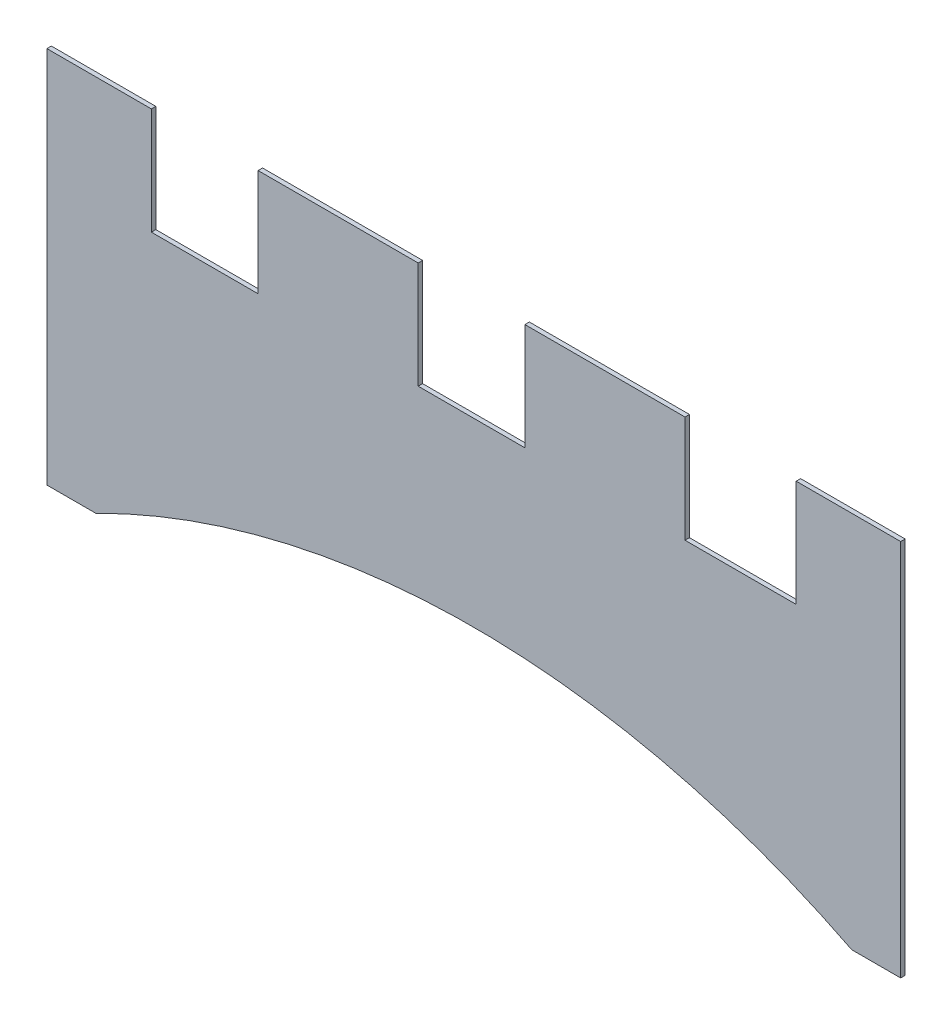
ISO-10303-21;
HEADER;
FILE_DESCRIPTION(('STEP AP214'),'2;1');
FILE_NAME('part.step','',(''),(''),'','','');
FILE_SCHEMA(('AUTOMOTIVE_DESIGN { 1 0 10303 214 1 1 1 1 }'));
ENDSEC;
DATA;
#1=APPLICATION_CONTEXT('core data for automotive mechanical design processes');
#2=APPLICATION_PROTOCOL_DEFINITION('international standard','automotive_design',2000,#1);
#3=PRODUCT_CONTEXT('',#1,'mechanical');
#4=PRODUCT('Part','Part','',(#3));
#5=PRODUCT_RELATED_PRODUCT_CATEGORY('part','',(#4));
#6=PRODUCT_DEFINITION_FORMATION('','',#4);
#7=PRODUCT_DEFINITION_CONTEXT('part definition',#1,'design');
#8=PRODUCT_DEFINITION('design','',#6,#7);
#9=PRODUCT_DEFINITION_SHAPE('','',#8);
#10=(LENGTH_UNIT() NAMED_UNIT(*) SI_UNIT(.MILLI.,.METRE.));
#11=(NAMED_UNIT(*) PLANE_ANGLE_UNIT() SI_UNIT($,.RADIAN.));
#12=(NAMED_UNIT(*) SI_UNIT($,.STERADIAN.) SOLID_ANGLE_UNIT());
#13=UNCERTAINTY_MEASURE_WITH_UNIT(LENGTH_MEASURE(1.E-05),#10,'distance_accuracy_value','');
#14=(GEOMETRIC_REPRESENTATION_CONTEXT(3) GLOBAL_UNCERTAINTY_ASSIGNED_CONTEXT((#13)) GLOBAL_UNIT_ASSIGNED_CONTEXT((#10,
#11,#12)) REPRESENTATION_CONTEXT('',''));
#15=CARTESIAN_POINT('',(0.,0.,0.));
#16=DIRECTION('',(0.,0.,1.));
#17=DIRECTION('',(1.,0.,0.));
#18=AXIS2_PLACEMENT_3D('',#15,#16,#17);
#19=CARTESIAN_POINT('',(0.,0.,6.35));
#20=DIRECTION('',(0.,0.,1.));
#21=DIRECTION('',(1.,0.,0.));
#22=AXIS2_PLACEMENT_3D('',#19,#20,#21);
#23=PLANE('',#22);
#24=DIRECTION('',(0.,1.,0.));
#25=VECTOR('',#24,1.);
#26=CARTESIAN_POINT('',(460.375,346.075,6.35));
#27=LINE('',#26,#25);
#28=CARTESIAN_POINT('',(460.375,193.675,6.35));
#29=VERTEX_POINT('',#28);
#30=CARTESIAN_POINT('',(460.375,346.075,6.35));
#31=VERTEX_POINT('',#30);
#32=EDGE_CURVE('E159',#29,#31,#27,.T.);
#33=ORIENTED_EDGE('',*,*,#32,.F.);
#34=DIRECTION('',(1.,0.,0.));
#35=VECTOR('',#34,1.);
#36=CARTESIAN_POINT('',(609.6,193.675,6.35));
#37=LINE('',#36,#35);
#38=CARTESIAN_POINT('',(301.625,193.675,6.35));
#39=VERTEX_POINT('',#38);
#40=EDGE_CURVE('E241',#39,#29,#37,.T.);
#41=ORIENTED_EDGE('',*,*,#40,.F.);
#42=DIRECTION('',(0.,1.,0.));
#43=VECTOR('',#42,1.);
#44=CARTESIAN_POINT('',(301.625,193.675,6.35));
#45=LINE('',#44,#43);
#46=CARTESIAN_POINT('',(301.625,346.075,6.35));
#47=VERTEX_POINT('',#46);
#48=EDGE_CURVE('E235',#47,#39,#45,.F.);
#49=ORIENTED_EDGE('',*,*,#48,.F.);
#50=DIRECTION('',(1.,0.,0.));
#51=VECTOR('',#50,1.);
#52=CARTESIAN_POINT('',(301.625,346.075,6.35));
#53=LINE('',#52,#51);
#54=CARTESIAN_POINT('',(73.025,346.075,6.35));
#55=VERTEX_POINT('',#54);
#56=EDGE_CURVE('E227',#55,#47,#53,.T.);
#57=ORIENTED_EDGE('',*,*,#56,.F.);
#58=DIRECTION('',(0.,1.,0.));
#59=VECTOR('',#58,1.);
#60=CARTESIAN_POINT('',(73.025,346.075,6.35));
#61=LINE('',#60,#59);
#62=CARTESIAN_POINT('',(73.025,193.675,6.35));
#63=VERTEX_POINT('',#62);
#64=EDGE_CURVE('E225',#63,#55,#61,.T.);
#65=ORIENTED_EDGE('',*,*,#64,.F.);
#66=DIRECTION('',(1.,0.,0.));
#67=VECTOR('',#66,1.);
#68=CARTESIAN_POINT('',(609.6,193.675,6.35));
#69=LINE('',#68,#67);
#70=CARTESIAN_POINT('',(-79.375,193.675,6.35));
#71=VERTEX_POINT('',#70);
#72=EDGE_CURVE('E220',#71,#63,#69,.T.);
#73=ORIENTED_EDGE('',*,*,#72,.F.);
#74=DIRECTION('',(0.,1.,0.));
#75=VECTOR('',#74,1.);
#76=CARTESIAN_POINT('',(-79.375,193.675,6.35));
#77=LINE('',#76,#75);
#78=CARTESIAN_POINT('',(-79.375,346.075,6.35));
#79=VERTEX_POINT('',#78);
#80=EDGE_CURVE('E214',#79,#71,#77,.F.);
#81=ORIENTED_EDGE('',*,*,#80,.F.);
#82=DIRECTION('',(1.,0.,0.));
#83=VECTOR('',#82,1.);
#84=CARTESIAN_POINT('',(-79.375,346.075,6.35));
#85=LINE('',#84,#83);
#86=CARTESIAN_POINT('',(-307.975,346.075,6.35));
#87=VERTEX_POINT('',#86);
#88=EDGE_CURVE('E206',#87,#79,#85,.T.);
#89=ORIENTED_EDGE('',*,*,#88,.F.);
#90=DIRECTION('',(0.,1.,0.));
#91=VECTOR('',#90,1.);
#92=CARTESIAN_POINT('',(-307.975,346.075,6.35));
#93=LINE('',#92,#91);
#94=CARTESIAN_POINT('',(-307.975,193.675,6.35));
#95=VERTEX_POINT('',#94);
#96=EDGE_CURVE('E204',#95,#87,#93,.T.);
#97=ORIENTED_EDGE('',*,*,#96,.F.);
#98=DIRECTION('',(1.,0.,0.));
#99=VECTOR('',#98,1.);
#100=CARTESIAN_POINT('',(609.6,193.675,6.35));
#101=LINE('',#100,#99);
#102=CARTESIAN_POINT('',(-460.375,193.675,6.35));
#103=VERTEX_POINT('',#102);
#104=EDGE_CURVE('E199',#103,#95,#101,.T.);
#105=ORIENTED_EDGE('',*,*,#104,.F.);
#106=DIRECTION('',(0.,1.,0.));
#107=VECTOR('',#106,1.);
#108=CARTESIAN_POINT('',(-460.375,193.675,6.35));
#109=LINE('',#108,#107);
#110=CARTESIAN_POINT('',(-460.375,346.075,6.35));
#111=VERTEX_POINT('',#110);
#112=EDGE_CURVE('E193',#111,#103,#109,.F.);
#113=ORIENTED_EDGE('',*,*,#112,.F.);
#114=DIRECTION('',(1.,0.,0.));
#115=VECTOR('',#114,1.);
#116=CARTESIAN_POINT('',(-460.375,346.075,6.35));
#117=LINE('',#116,#115);
#118=CARTESIAN_POINT('',(-609.6,346.075,6.35));
#119=VERTEX_POINT('',#118);
#120=EDGE_CURVE('E185',#119,#111,#117,.T.);
#121=ORIENTED_EDGE('',*,*,#120,.F.);
#122=DIRECTION('',(0.,1.,0.));
#123=VECTOR('',#122,1.);
#124=CARTESIAN_POINT('',(-609.6,193.675,6.35));
#125=LINE('',#124,#123);
#126=CARTESIAN_POINT('',(-609.6,-193.675,6.35));
#127=VERTEX_POINT('',#126);
#128=EDGE_CURVE('E183',#127,#119,#125,.T.);
#129=ORIENTED_EDGE('',*,*,#128,.F.);
#130=DIRECTION('',(1.,0.,0.));
#131=VECTOR('',#130,1.);
#132=CARTESIAN_POINT('',(-609.6,-193.675,6.35));
#133=LINE('',#132,#131);
#134=CARTESIAN_POINT('',(-539.749999999901,-193.675000000033,6.35));
#135=VERTEX_POINT('',#134);
#136=EDGE_CURVE('E48',#135,#127,#133,.F.);
#137=ORIENTED_EDGE('',*,*,#136,.F.);
#138=CARTESIAN_POINT('',(0.,-1258.4887759722,6.35));
#139=DIRECTION('',(0.,0.,1.));
#140=DIRECTION('',(1.,0.,0.));
#141=AXIS2_PLACEMENT_3D('',#138,#139,#140);
#142=CIRCLE('',#141,1193.8);
#143=CARTESIAN_POINT('',(539.749999999917,-193.675,6.35));
#144=VERTEX_POINT('',#143);
#145=EDGE_CURVE('E20',#135,#144,#142,.F.);
#146=ORIENTED_EDGE('',*,*,#145,.T.);
#147=DIRECTION('',(1.,0.,0.));
#148=VECTOR('',#147,1.);
#149=CARTESIAN_POINT('',(-609.6,-193.675,6.35));
#150=LINE('',#149,#148);
#151=CARTESIAN_POINT('',(609.6,-193.675,6.35));
#152=VERTEX_POINT('',#151);
#153=EDGE_CURVE('E147',#152,#144,#150,.F.);
#154=ORIENTED_EDGE('',*,*,#153,.F.);
#155=DIRECTION('',(0.,1.,0.));
#156=VECTOR('',#155,1.);
#157=CARTESIAN_POINT('',(609.6,-193.675,6.35));
#158=LINE('',#157,#156);
#159=CARTESIAN_POINT('',(609.6,346.075,6.35));
#160=VERTEX_POINT('',#159);
#161=EDGE_CURVE('E142',#160,#152,#158,.F.);
#162=ORIENTED_EDGE('',*,*,#161,.F.);
#163=DIRECTION('',(1.,0.,0.));
#164=VECTOR('',#163,1.);
#165=CARTESIAN_POINT('',(609.6,346.075,6.35));
#166=LINE('',#165,#164);
#167=EDGE_CURVE('E145',#31,#160,#166,.T.);
#168=ORIENTED_EDGE('',*,*,#167,.F.);
#169=EDGE_LOOP('',(#33,#41,#49,#57,#65,#73,#81,#89,#97,#105,#113,#121,#129,#137,#146,#154,#162,#168));
#170=FACE_BOUND('',#169,.T.);
#171=ADVANCED_FACE('F17',(#170),#23,.T.);
#172=CARTESIAN_POINT('',(609.6,-193.675,0.));
#173=DIRECTION('',(1.,0.,0.));
#174=DIRECTION('',(0.,0.,-1.));
#175=AXIS2_PLACEMENT_3D('',#172,#173,#174);
#176=PLANE('',#175);
#177=DIRECTION('',(0.,0.,1.));
#178=VECTOR('',#177,1.);
#179=CARTESIAN_POINT('',(609.6,346.075,6.35));
#180=LINE('',#179,#178);
#181=CARTESIAN_POINT('',(609.6,346.075,0.));
#182=VERTEX_POINT('',#181);
#183=EDGE_CURVE('E152',#160,#182,#180,.F.);
#184=ORIENTED_EDGE('',*,*,#183,.F.);
#185=ORIENTED_EDGE('',*,*,#161,.T.);
#186=DIRECTION('',(0.,0.,-1.));
#187=VECTOR('',#186,1.);
#188=CARTESIAN_POINT('',(609.6,-193.675,0.));
#189=LINE('',#188,#187);
#190=CARTESIAN_POINT('',(609.6,-193.675,0.));
#191=VERTEX_POINT('',#190);
#192=EDGE_CURVE('E173',#191,#152,#189,.F.);
#193=ORIENTED_EDGE('',*,*,#192,.F.);
#194=DIRECTION('',(0.,1.,0.));
#195=VECTOR('',#194,1.);
#196=CARTESIAN_POINT('',(609.6,0.,0.));
#197=LINE('',#196,#195);
#198=EDGE_CURVE('E164',#191,#182,#197,.T.);
#199=ORIENTED_EDGE('',*,*,#198,.T.);
#200=EDGE_LOOP('',(#184,#185,#193,#199));
#201=FACE_BOUND('',#200,.T.);
#202=ADVANCED_FACE('F162',(#201),#176,.T.);
#203=CARTESIAN_POINT('',(609.6,346.075,6.35));
#204=DIRECTION('',(0.,1.,0.));
#205=DIRECTION('',(0.,0.,1.));
#206=AXIS2_PLACEMENT_3D('',#203,#204,#205);
#207=PLANE('',#206);
#208=DIRECTION('',(0.,0.,1.));
#209=VECTOR('',#208,1.);
#210=CARTESIAN_POINT('',(460.375,346.075,6.35));
#211=LINE('',#210,#209);
#212=CARTESIAN_POINT('',(460.375,346.075,0.));
#213=VERTEX_POINT('',#212);
#214=EDGE_CURVE('E158',#31,#213,#211,.F.);
#215=ORIENTED_EDGE('',*,*,#214,.F.);
#216=ORIENTED_EDGE('',*,*,#167,.T.);
#217=ORIENTED_EDGE('',*,*,#183,.T.);
#218=DIRECTION('',(1.,0.,0.));
#219=VECTOR('',#218,1.);
#220=CARTESIAN_POINT('',(0.,346.075,0.));
#221=LINE('',#220,#219);
#222=EDGE_CURVE('E270',#182,#213,#221,.F.);
#223=ORIENTED_EDGE('',*,*,#222,.T.);
#224=EDGE_LOOP('',(#215,#216,#217,#223));
#225=FACE_BOUND('',#224,.T.);
#226=ADVANCED_FACE('F155',(#225),#207,.T.);
#227=CARTESIAN_POINT('',(460.375,346.075,6.35));
#228=DIRECTION('',(-1.,0.,0.));
#229=DIRECTION('',(0.,0.,1.));
#230=AXIS2_PLACEMENT_3D('',#227,#228,#229);
#231=PLANE('',#230);
#232=DIRECTION('',(0.,1.,0.));
#233=VECTOR('',#232,1.);
#234=CARTESIAN_POINT('',(460.375,0.,0.));
#235=LINE('',#234,#233);
#236=CARTESIAN_POINT('',(460.375,193.675,0.));
#237=VERTEX_POINT('',#236);
#238=EDGE_CURVE('E366',#213,#237,#235,.F.);
#239=ORIENTED_EDGE('',*,*,#238,.T.);
#240=DIRECTION('',(0.,0.,1.));
#241=VECTOR('',#240,1.);
#242=CARTESIAN_POINT('',(460.375,193.675,0.));
#243=LINE('',#242,#241);
#244=EDGE_CURVE('E238',#29,#237,#243,.F.);
#245=ORIENTED_EDGE('',*,*,#244,.F.);
#246=ORIENTED_EDGE('',*,*,#32,.T.);
#247=ORIENTED_EDGE('',*,*,#214,.T.);
#248=EDGE_LOOP('',(#239,#245,#246,#247));
#249=FACE_BOUND('',#248,.T.);
#250=ADVANCED_FACE('F385',(#249),#231,.T.);
#251=CARTESIAN_POINT('',(609.6,193.675,0.));
#252=DIRECTION('',(0.,1.,0.));
#253=DIRECTION('',(0.,0.,1.));
#254=AXIS2_PLACEMENT_3D('',#251,#252,#253);
#255=PLANE('',#254);
#256=ORIENTED_EDGE('',*,*,#244,.T.);
#257=DIRECTION('',(1.,0.,0.));
#258=VECTOR('',#257,1.);
#259=CARTESIAN_POINT('',(0.,193.675,0.));
#260=LINE('',#259,#258);
#261=CARTESIAN_POINT('',(301.625,193.675,0.));
#262=VERTEX_POINT('',#261);
#263=EDGE_CURVE('E358',#237,#262,#260,.F.);
#264=ORIENTED_EDGE('',*,*,#263,.T.);
#265=DIRECTION('',(0.,0.,-1.));
#266=VECTOR('',#265,1.);
#267=CARTESIAN_POINT('',(301.625,193.675,6.35));
#268=LINE('',#267,#266);
#269=EDGE_CURVE('E237',#39,#262,#268,.T.);
#270=ORIENTED_EDGE('',*,*,#269,.F.);
#271=ORIENTED_EDGE('',*,*,#40,.T.);
#272=EDGE_LOOP('',(#256,#264,#270,#271));
#273=FACE_BOUND('',#272,.T.);
#274=ADVANCED_FACE('F390',(#273),#255,.T.);
#275=CARTESIAN_POINT('',(301.625,193.675,6.35));
#276=DIRECTION('',(1.,0.,0.));
#277=DIRECTION('',(0.,0.,-1.));
#278=AXIS2_PLACEMENT_3D('',#275,#276,#277);
#279=PLANE('',#278);
#280=ORIENTED_EDGE('',*,*,#48,.T.);
#281=ORIENTED_EDGE('',*,*,#269,.T.);
#282=DIRECTION('',(0.,1.,0.));
#283=VECTOR('',#282,1.);
#284=CARTESIAN_POINT('',(301.625,0.,0.));
#285=LINE('',#284,#283);
#286=CARTESIAN_POINT('',(301.625,346.075,0.));
#287=VERTEX_POINT('',#286);
#288=EDGE_CURVE('E350',#262,#287,#285,.T.);
#289=ORIENTED_EDGE('',*,*,#288,.T.);
#290=DIRECTION('',(0.,0.,1.));
#291=VECTOR('',#290,1.);
#292=CARTESIAN_POINT('',(301.625,346.075,6.35));
#293=LINE('',#292,#291);
#294=EDGE_CURVE('E232',#47,#287,#293,.F.);
#295=ORIENTED_EDGE('',*,*,#294,.F.);
#296=EDGE_LOOP('',(#280,#281,#289,#295));
#297=FACE_BOUND('',#296,.T.);
#298=ADVANCED_FACE('F392',(#297),#279,.T.);
#299=CARTESIAN_POINT('',(301.625,346.075,6.35));
#300=DIRECTION('',(0.,1.,0.));
#301=DIRECTION('',(0.,0.,1.));
#302=AXIS2_PLACEMENT_3D('',#299,#300,#301);
#303=PLANE('',#302);
#304=DIRECTION('',(0.,0.,1.));
#305=VECTOR('',#304,1.);
#306=CARTESIAN_POINT('',(73.025,346.075,6.35));
#307=LINE('',#306,#305);
#308=CARTESIAN_POINT('',(73.025,346.075,0.));
#309=VERTEX_POINT('',#308);
#310=EDGE_CURVE('E222',#55,#309,#307,.F.);
#311=ORIENTED_EDGE('',*,*,#310,.F.);
#312=ORIENTED_EDGE('',*,*,#56,.T.);
#313=ORIENTED_EDGE('',*,*,#294,.T.);
#314=DIRECTION('',(1.,0.,0.));
#315=VECTOR('',#314,1.);
#316=CARTESIAN_POINT('',(0.,346.075,0.));
#317=LINE('',#316,#315);
#318=EDGE_CURVE('E342',#287,#309,#317,.F.);
#319=ORIENTED_EDGE('',*,*,#318,.T.);
#320=EDGE_LOOP('',(#311,#312,#313,#319));
#321=FACE_BOUND('',#320,.T.);
#322=ADVANCED_FACE('F399',(#321),#303,.T.);
#323=CARTESIAN_POINT('',(73.025,346.075,6.35));
#324=DIRECTION('',(-1.,0.,0.));
#325=DIRECTION('',(0.,0.,1.));
#326=AXIS2_PLACEMENT_3D('',#323,#324,#325);
#327=PLANE('',#326);
#328=DIRECTION('',(0.,1.,0.));
#329=VECTOR('',#328,1.);
#330=CARTESIAN_POINT('',(73.025,0.,0.));
#331=LINE('',#330,#329);
#332=CARTESIAN_POINT('',(73.025,193.675,0.));
#333=VERTEX_POINT('',#332);
#334=EDGE_CURVE('E334',#309,#333,#331,.F.);
#335=ORIENTED_EDGE('',*,*,#334,.T.);
#336=DIRECTION('',(0.,0.,1.));
#337=VECTOR('',#336,1.);
#338=CARTESIAN_POINT('',(73.025,193.675,0.));
#339=LINE('',#338,#337);
#340=EDGE_CURVE('E217',#63,#333,#339,.F.);
#341=ORIENTED_EDGE('',*,*,#340,.F.);
#342=ORIENTED_EDGE('',*,*,#64,.T.);
#343=ORIENTED_EDGE('',*,*,#310,.T.);
#344=EDGE_LOOP('',(#335,#341,#342,#343));
#345=FACE_BOUND('',#344,.T.);
#346=ADVANCED_FACE('F405',(#345),#327,.T.);
#347=CARTESIAN_POINT('',(609.6,193.675,0.));
#348=DIRECTION('',(0.,1.,0.));
#349=DIRECTION('',(0.,0.,1.));
#350=AXIS2_PLACEMENT_3D('',#347,#348,#349);
#351=PLANE('',#350);
#352=DIRECTION('',(1.,0.,0.));
#353=VECTOR('',#352,1.);
#354=CARTESIAN_POINT('',(0.,193.675,0.));
#355=LINE('',#354,#353);
#356=CARTESIAN_POINT('',(-79.375,193.675,0.));
#357=VERTEX_POINT('',#356);
#358=EDGE_CURVE('E326',#333,#357,#355,.F.);
#359=ORIENTED_EDGE('',*,*,#358,.T.);
#360=DIRECTION('',(0.,0.,-1.));
#361=VECTOR('',#360,1.);
#362=CARTESIAN_POINT('',(-79.375,193.675,6.35));
#363=LINE('',#362,#361);
#364=EDGE_CURVE('E216',#71,#357,#363,.T.);
#365=ORIENTED_EDGE('',*,*,#364,.F.);
#366=ORIENTED_EDGE('',*,*,#72,.T.);
#367=ORIENTED_EDGE('',*,*,#340,.T.);
#368=EDGE_LOOP('',(#359,#365,#366,#367));
#369=FACE_BOUND('',#368,.T.);
#370=ADVANCED_FACE('F407',(#369),#351,.T.);
#371=CARTESIAN_POINT('',(-79.375,193.675,6.35));
#372=DIRECTION('',(1.,0.,0.));
#373=DIRECTION('',(0.,0.,-1.));
#374=AXIS2_PLACEMENT_3D('',#371,#372,#373);
#375=PLANE('',#374);
#376=ORIENTED_EDGE('',*,*,#80,.T.);
#377=ORIENTED_EDGE('',*,*,#364,.T.);
#378=DIRECTION('',(0.,1.,0.));
#379=VECTOR('',#378,1.);
#380=CARTESIAN_POINT('',(-79.375,0.,0.));
#381=LINE('',#380,#379);
#382=CARTESIAN_POINT('',(-79.375,346.075,0.));
#383=VERTEX_POINT('',#382);
#384=EDGE_CURVE('E318',#357,#383,#381,.T.);
#385=ORIENTED_EDGE('',*,*,#384,.T.);
#386=DIRECTION('',(0.,0.,1.));
#387=VECTOR('',#386,1.);
#388=CARTESIAN_POINT('',(-79.375,346.075,6.35));
#389=LINE('',#388,#387);
#390=EDGE_CURVE('E211',#79,#383,#389,.F.);
#391=ORIENTED_EDGE('',*,*,#390,.F.);
#392=EDGE_LOOP('',(#376,#377,#385,#391));
#393=FACE_BOUND('',#392,.T.);
#394=ADVANCED_FACE('F413',(#393),#375,.T.);
#395=CARTESIAN_POINT('',(-79.375,346.075,6.35));
#396=DIRECTION('',(0.,1.,0.));
#397=DIRECTION('',(0.,0.,1.));
#398=AXIS2_PLACEMENT_3D('',#395,#396,#397);
#399=PLANE('',#398);
#400=DIRECTION('',(0.,0.,1.));
#401=VECTOR('',#400,1.);
#402=CARTESIAN_POINT('',(-307.975,346.075,6.35));
#403=LINE('',#402,#401);
#404=CARTESIAN_POINT('',(-307.975,346.075,0.));
#405=VERTEX_POINT('',#404);
#406=EDGE_CURVE('E201',#87,#405,#403,.F.);
#407=ORIENTED_EDGE('',*,*,#406,.F.);
#408=ORIENTED_EDGE('',*,*,#88,.T.);
#409=ORIENTED_EDGE('',*,*,#390,.T.);
#410=DIRECTION('',(1.,0.,0.));
#411=VECTOR('',#410,1.);
#412=CARTESIAN_POINT('',(0.,346.075,0.));
#413=LINE('',#412,#411);
#414=EDGE_CURVE('E310',#383,#405,#413,.F.);
#415=ORIENTED_EDGE('',*,*,#414,.T.);
#416=EDGE_LOOP('',(#407,#408,#409,#415));
#417=FACE_BOUND('',#416,.T.);
#418=ADVANCED_FACE('F418',(#417),#399,.T.);
#419=CARTESIAN_POINT('',(-307.975,346.075,6.35));
#420=DIRECTION('',(-1.,0.,0.));
#421=DIRECTION('',(0.,0.,1.));
#422=AXIS2_PLACEMENT_3D('',#419,#420,#421);
#423=PLANE('',#422);
#424=DIRECTION('',(0.,1.,0.));
#425=VECTOR('',#424,1.);
#426=CARTESIAN_POINT('',(-307.975,0.,0.));
#427=LINE('',#426,#425);
#428=CARTESIAN_POINT('',(-307.975,193.675,0.));
#429=VERTEX_POINT('',#428);
#430=EDGE_CURVE('E302',#405,#429,#427,.F.);
#431=ORIENTED_EDGE('',*,*,#430,.T.);
#432=DIRECTION('',(0.,0.,1.));
#433=VECTOR('',#432,1.);
#434=CARTESIAN_POINT('',(-307.975,193.675,0.));
#435=LINE('',#434,#433);
#436=EDGE_CURVE('E196',#95,#429,#435,.F.);
#437=ORIENTED_EDGE('',*,*,#436,.F.);
#438=ORIENTED_EDGE('',*,*,#96,.T.);
#439=ORIENTED_EDGE('',*,*,#406,.T.);
#440=EDGE_LOOP('',(#431,#437,#438,#439));
#441=FACE_BOUND('',#440,.T.);
#442=ADVANCED_FACE('F420',(#441),#423,.T.);
#443=CARTESIAN_POINT('',(609.6,193.675,0.));
#444=DIRECTION('',(0.,1.,0.));
#445=DIRECTION('',(0.,0.,1.));
#446=AXIS2_PLACEMENT_3D('',#443,#444,#445);
#447=PLANE('',#446);
#448=DIRECTION('',(1.,0.,0.));
#449=VECTOR('',#448,1.);
#450=CARTESIAN_POINT('',(0.,193.675,0.));
#451=LINE('',#450,#449);
#452=CARTESIAN_POINT('',(-460.375,193.675,0.));
#453=VERTEX_POINT('',#452);
#454=EDGE_CURVE('E294',#429,#453,#451,.F.);
#455=ORIENTED_EDGE('',*,*,#454,.T.);
#456=DIRECTION('',(0.,0.,-1.));
#457=VECTOR('',#456,1.);
#458=CARTESIAN_POINT('',(-460.375,193.675,6.35));
#459=LINE('',#458,#457);
#460=EDGE_CURVE('E195',#103,#453,#459,.T.);
#461=ORIENTED_EDGE('',*,*,#460,.F.);
#462=ORIENTED_EDGE('',*,*,#104,.T.);
#463=ORIENTED_EDGE('',*,*,#436,.T.);
#464=EDGE_LOOP('',(#455,#461,#462,#463));
#465=FACE_BOUND('',#464,.T.);
#466=ADVANCED_FACE('F427',(#465),#447,.T.);
#467=CARTESIAN_POINT('',(-460.375,193.675,6.35));
#468=DIRECTION('',(1.,0.,0.));
#469=DIRECTION('',(0.,0.,-1.));
#470=AXIS2_PLACEMENT_3D('',#467,#468,#469);
#471=PLANE('',#470);
#472=ORIENTED_EDGE('',*,*,#112,.T.);
#473=ORIENTED_EDGE('',*,*,#460,.T.);
#474=DIRECTION('',(0.,1.,0.));
#475=VECTOR('',#474,1.);
#476=CARTESIAN_POINT('',(-460.375,0.,0.));
#477=LINE('',#476,#475);
#478=CARTESIAN_POINT('',(-460.375,346.075,0.));
#479=VERTEX_POINT('',#478);
#480=EDGE_CURVE('E286',#453,#479,#477,.T.);
#481=ORIENTED_EDGE('',*,*,#480,.T.);
#482=DIRECTION('',(0.,0.,1.));
#483=VECTOR('',#482,1.);
#484=CARTESIAN_POINT('',(-460.375,346.075,6.35));
#485=LINE('',#484,#483);
#486=EDGE_CURVE('E190',#111,#479,#485,.F.);
#487=ORIENTED_EDGE('',*,*,#486,.F.);
#488=EDGE_LOOP('',(#472,#473,#481,#487));
#489=FACE_BOUND('',#488,.T.);
#490=ADVANCED_FACE('F435',(#489),#471,.T.);
#491=CARTESIAN_POINT('',(-460.375,346.075,6.35));
#492=DIRECTION('',(0.,1.,0.));
#493=DIRECTION('',(0.,0.,1.));
#494=AXIS2_PLACEMENT_3D('',#491,#492,#493);
#495=PLANE('',#494);
#496=DIRECTION('',(0.,0.,1.));
#497=VECTOR('',#496,1.);
#498=CARTESIAN_POINT('',(-609.6,346.075,0.));
#499=LINE('',#498,#497);
#500=CARTESIAN_POINT('',(-609.6,346.075,0.));
#501=VERTEX_POINT('',#500);
#502=EDGE_CURVE('E180',#119,#501,#499,.F.);
#503=ORIENTED_EDGE('',*,*,#502,.F.);
#504=ORIENTED_EDGE('',*,*,#120,.T.);
#505=ORIENTED_EDGE('',*,*,#486,.T.);
#506=DIRECTION('',(1.,0.,0.));
#507=VECTOR('',#506,1.);
#508=CARTESIAN_POINT('',(0.,346.075,0.));
#509=LINE('',#508,#507);
#510=EDGE_CURVE('E258',#479,#501,#509,.F.);
#511=ORIENTED_EDGE('',*,*,#510,.T.);
#512=EDGE_LOOP('',(#503,#504,#505,#511));
#513=FACE_BOUND('',#512,.T.);
#514=ADVANCED_FACE('F434',(#513),#495,.T.);
#515=CARTESIAN_POINT('',(-609.6,193.675,0.));
#516=DIRECTION('',(-1.,0.,0.));
#517=DIRECTION('',(0.,0.,1.));
#518=AXIS2_PLACEMENT_3D('',#515,#516,#517);
#519=PLANE('',#518);
#520=ORIENTED_EDGE('',*,*,#502,.T.);
#521=DIRECTION('',(0.,1.,0.));
#522=VECTOR('',#521,1.);
#523=CARTESIAN_POINT('',(-609.6,0.,0.));
#524=LINE('',#523,#522);
#525=CARTESIAN_POINT('',(-609.6,-193.675,0.));
#526=VERTEX_POINT('',#525);
#527=EDGE_CURVE('E254',#501,#526,#524,.F.);
#528=ORIENTED_EDGE('',*,*,#527,.T.);
#529=DIRECTION('',(0.,0.,-1.));
#530=VECTOR('',#529,1.);
#531=CARTESIAN_POINT('',(-609.6,-193.675,0.));
#532=LINE('',#531,#530);
#533=EDGE_CURVE('E179',#127,#526,#532,.T.);
#534=ORIENTED_EDGE('',*,*,#533,.F.);
#535=ORIENTED_EDGE('',*,*,#128,.T.);
#536=EDGE_LOOP('',(#520,#528,#534,#535));
#537=FACE_BOUND('',#536,.T.);
#538=ADVANCED_FACE('F443',(#537),#519,.T.);
#539=CARTESIAN_POINT('',(-609.6,-193.675,0.));
#540=DIRECTION('',(0.,-1.,0.));
#541=DIRECTION('',(0.,0.,-1.));
#542=AXIS2_PLACEMENT_3D('',#539,#540,#541);
#543=PLANE('',#542);
#544=ORIENTED_EDGE('',*,*,#533,.T.);
#545=DIRECTION('',(1.,0.,0.));
#546=VECTOR('',#545,1.);
#547=CARTESIAN_POINT('',(0.,-193.675,0.));
#548=LINE('',#547,#546);
#549=CARTESIAN_POINT('',(-539.749999999901,-193.675000000033,0.));
#550=VERTEX_POINT('',#549);
#551=EDGE_CURVE('E250',#526,#550,#548,.T.);
#552=ORIENTED_EDGE('',*,*,#551,.T.);
#553=DIRECTION('',(0.,0.,1.));
#554=VECTOR('',#553,1.);
#555=CARTESIAN_POINT('',(-539.749999999966,-193.675000000067,6.35));
#556=LINE('',#555,#554);
#557=EDGE_CURVE('E273',#550,#135,#556,.T.);
#558=ORIENTED_EDGE('',*,*,#557,.T.);
#559=ORIENTED_EDGE('',*,*,#136,.T.);
#560=EDGE_LOOP('',(#544,#552,#558,#559));
#561=FACE_BOUND('',#560,.T.);
#562=ADVANCED_FACE('F457',(#561),#543,.T.);
#563=CARTESIAN_POINT('',(0.,-1258.4887759722,6.35));
#564=DIRECTION('',(0.,0.,1.));
#565=DIRECTION('',(1.,0.,0.));
#566=AXIS2_PLACEMENT_3D('',#563,#564,#565);
#567=CYLINDRICAL_SURFACE('',#566,1193.8);
#568=ORIENTED_EDGE('',*,*,#145,.F.);
#569=ORIENTED_EDGE('',*,*,#557,.F.);
#570=CARTESIAN_POINT('',(0.,-1258.4887759722,0.));
#571=DIRECTION('',(0.,0.,1.));
#572=DIRECTION('',(1.,0.,0.));
#573=AXIS2_PLACEMENT_3D('',#570,#571,#572);
#574=CIRCLE('',#573,1193.8);
#575=CARTESIAN_POINT('',(539.749999999917,-193.675,0.));
#576=VERTEX_POINT('',#575);
#577=EDGE_CURVE('E26',#550,#576,#574,.F.);
#578=ORIENTED_EDGE('',*,*,#577,.T.);
#579=DIRECTION('',(0.,0.,-1.));
#580=VECTOR('',#579,1.);
#581=CARTESIAN_POINT('',(539.75,-193.675,0.));
#582=LINE('',#581,#580);
#583=EDGE_CURVE('E34',#144,#576,#582,.T.);
#584=ORIENTED_EDGE('',*,*,#583,.F.);
#585=EDGE_LOOP('',(#568,#569,#578,#584));
#586=FACE_BOUND('',#585,.T.);
#587=ADVANCED_FACE('F452',(#586),#567,.F.);
#588=CARTESIAN_POINT('',(-609.6,-193.675,0.));
#589=DIRECTION('',(0.,-1.,0.));
#590=DIRECTION('',(0.,0.,-1.));
#591=AXIS2_PLACEMENT_3D('',#588,#589,#590);
#592=PLANE('',#591);
#593=ORIENTED_EDGE('',*,*,#583,.T.);
#594=DIRECTION('',(1.,0.,0.));
#595=VECTOR('',#594,1.);
#596=CARTESIAN_POINT('',(0.,-193.675,0.));
#597=LINE('',#596,#595);
#598=EDGE_CURVE('E11',#576,#191,#597,.T.);
#599=ORIENTED_EDGE('',*,*,#598,.T.);
#600=ORIENTED_EDGE('',*,*,#192,.T.);
#601=ORIENTED_EDGE('',*,*,#153,.T.);
#602=EDGE_LOOP('',(#593,#599,#600,#601));
#603=FACE_BOUND('',#602,.T.);
#604=ADVANCED_FACE('F447',(#603),#592,.T.);
#605=CARTESIAN_POINT('',(0.,0.,0.));
#606=DIRECTION('',(0.,0.,1.));
#607=DIRECTION('',(1.,0.,0.));
#608=AXIS2_PLACEMENT_3D('',#605,#606,#607);
#609=PLANE('',#608);
#610=ORIENTED_EDGE('',*,*,#577,.F.);
#611=ORIENTED_EDGE('',*,*,#551,.F.);
#612=ORIENTED_EDGE('',*,*,#527,.F.);
#613=ORIENTED_EDGE('',*,*,#510,.F.);
#614=ORIENTED_EDGE('',*,*,#480,.F.);
#615=ORIENTED_EDGE('',*,*,#454,.F.);
#616=ORIENTED_EDGE('',*,*,#430,.F.);
#617=ORIENTED_EDGE('',*,*,#414,.F.);
#618=ORIENTED_EDGE('',*,*,#384,.F.);
#619=ORIENTED_EDGE('',*,*,#358,.F.);
#620=ORIENTED_EDGE('',*,*,#334,.F.);
#621=ORIENTED_EDGE('',*,*,#318,.F.);
#622=ORIENTED_EDGE('',*,*,#288,.F.);
#623=ORIENTED_EDGE('',*,*,#263,.F.);
#624=ORIENTED_EDGE('',*,*,#238,.F.);
#625=ORIENTED_EDGE('',*,*,#222,.F.);
#626=ORIENTED_EDGE('',*,*,#198,.F.);
#627=ORIENTED_EDGE('',*,*,#598,.F.);
#628=EDGE_LOOP('',(#610,#611,#612,#613,#614,#615,#616,#617,#618,#619,#620,#621,#622,#623,#624,
#625,#626,#627));
#629=FACE_BOUND('',#628,.T.);
#630=ADVANCED_FACE('F380',(#629),#609,.F.);
#631=CLOSED_SHELL('',(#171,#202,#226,#250,#274,#298,#322,#346,#370,#394,#418,#442,#466,#490,
#514,#538,#562,#587,#604,#630));
#632=MANIFOLD_SOLID_BREP('B1',#631);
#633=ADVANCED_BREP_SHAPE_REPRESENTATION('',(#18,#632),#14);
#634=SHAPE_DEFINITION_REPRESENTATION(#9,#633);
ENDSEC;
END-ISO-10303-21;
